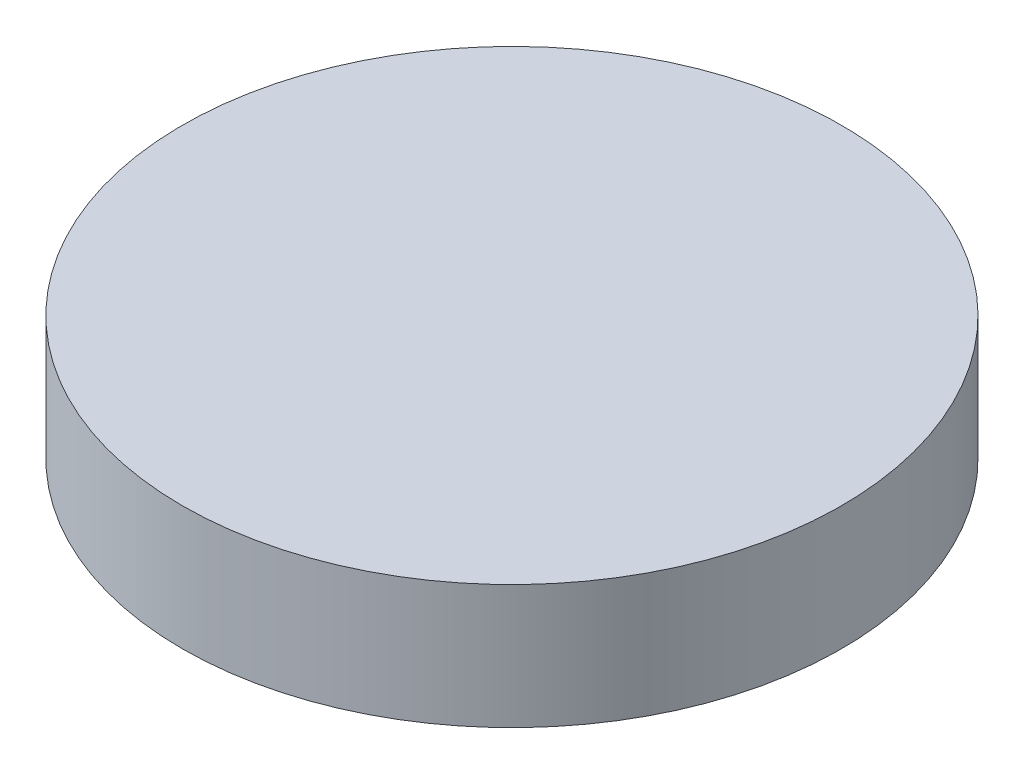
ISO-10303-21;
HEADER;
FILE_DESCRIPTION(('STEP AP214'),'2;1');
FILE_NAME('part.step','',(''),(''),'','','');
FILE_SCHEMA(('AUTOMOTIVE_DESIGN { 1 0 10303 214 1 1 1 1 }'));
ENDSEC;
DATA;
#1=APPLICATION_CONTEXT('core data for automotive mechanical design processes');
#2=APPLICATION_PROTOCOL_DEFINITION('international standard','automotive_design',2000,#1);
#3=PRODUCT_CONTEXT('',#1,'mechanical');
#4=PRODUCT('Part','Part','',(#3));
#5=PRODUCT_RELATED_PRODUCT_CATEGORY('part','',(#4));
#6=PRODUCT_DEFINITION_FORMATION('','',#4);
#7=PRODUCT_DEFINITION_CONTEXT('part definition',#1,'design');
#8=PRODUCT_DEFINITION('design','',#6,#7);
#9=PRODUCT_DEFINITION_SHAPE('','',#8);
#10=(LENGTH_UNIT() NAMED_UNIT(*) SI_UNIT(.MILLI.,.METRE.));
#11=(NAMED_UNIT(*) PLANE_ANGLE_UNIT() SI_UNIT($,.RADIAN.));
#12=(NAMED_UNIT(*) SI_UNIT($,.STERADIAN.) SOLID_ANGLE_UNIT());
#13=UNCERTAINTY_MEASURE_WITH_UNIT(LENGTH_MEASURE(1.E-05),#10,'distance_accuracy_value','');
#14=(GEOMETRIC_REPRESENTATION_CONTEXT(3) GLOBAL_UNCERTAINTY_ASSIGNED_CONTEXT((#13)) GLOBAL_UNIT_ASSIGNED_CONTEXT((#10,
#11,#12)) REPRESENTATION_CONTEXT('',''));
#15=CARTESIAN_POINT('',(0.,0.,0.));
#16=DIRECTION('',(0.,0.,1.));
#17=DIRECTION('',(1.,0.,0.));
#18=AXIS2_PLACEMENT_3D('',#15,#16,#17);
#19=CARTESIAN_POINT('',(0.,19.1,0.));
#20=DIRECTION('',(0.,-1.,0.));
#21=DIRECTION('',(0.,0.,-1.));
#22=AXIS2_PLACEMENT_3D('',#19,#20,#21);
#23=CYLINDRICAL_SURFACE('',#22,50.8);
#24=CARTESIAN_POINT('',(0.,19.1,0.));
#25=DIRECTION('',(0.,1.,0.));
#26=DIRECTION('',(0.,0.,1.));
#27=AXIS2_PLACEMENT_3D('',#24,#25,#26);
#28=CIRCLE('',#27,50.8);
#29=CARTESIAN_POINT('',(0.,19.1,50.8));
#30=VERTEX_POINT('',#29);
#31=EDGE_CURVE('E10',#30,#30,#28,.T.);
#32=ORIENTED_EDGE('',*,*,#31,.F.);
#33=EDGE_LOOP('',(#32));
#34=FACE_BOUND('',#33,.T.);
#35=CARTESIAN_POINT('',(0.,0.,0.));
#36=DIRECTION('',(0.,1.,0.));
#37=DIRECTION('',(0.,0.,1.));
#38=AXIS2_PLACEMENT_3D('',#35,#36,#37);
#39=CIRCLE('',#38,50.8);
#40=CARTESIAN_POINT('',(0.,0.,50.8));
#41=VERTEX_POINT('',#40);
#42=EDGE_CURVE('E36',#41,#41,#39,.T.);
#43=ORIENTED_EDGE('',*,*,#42,.T.);
#44=EDGE_LOOP('',(#43));
#45=FACE_BOUND('',#44,.T.);
#46=ADVANCED_FACE('F33',(#34,#45),#23,.T.);
#47=CARTESIAN_POINT('',(0.,19.1,0.));
#48=DIRECTION('',(0.,1.,0.));
#49=DIRECTION('',(0.,0.,1.));
#50=AXIS2_PLACEMENT_3D('',#47,#48,#49);
#51=PLANE('',#50);
#52=ORIENTED_EDGE('',*,*,#31,.T.);
#53=EDGE_LOOP('',(#52));
#54=FACE_BOUND('',#53,.T.);
#55=ADVANCED_FACE('F48',(#54),#51,.T.);
#56=CARTESIAN_POINT('',(0.,0.,0.));
#57=DIRECTION('',(0.,1.,0.));
#58=DIRECTION('',(0.,0.,1.));
#59=AXIS2_PLACEMENT_3D('',#56,#57,#58);
#60=PLANE('',#59);
#61=ORIENTED_EDGE('',*,*,#42,.F.);
#62=EDGE_LOOP('',(#61));
#63=FACE_BOUND('',#62,.T.);
#64=ADVANCED_FACE('F46',(#63),#60,.F.);
#65=CLOSED_SHELL('',(#46,#55,#64));
#66=MANIFOLD_SOLID_BREP('B2',#65);
#67=ADVANCED_BREP_SHAPE_REPRESENTATION('',(#18,#66),#14);
#68=SHAPE_DEFINITION_REPRESENTATION(#9,#67);
ENDSEC;
END-ISO-10303-21;
